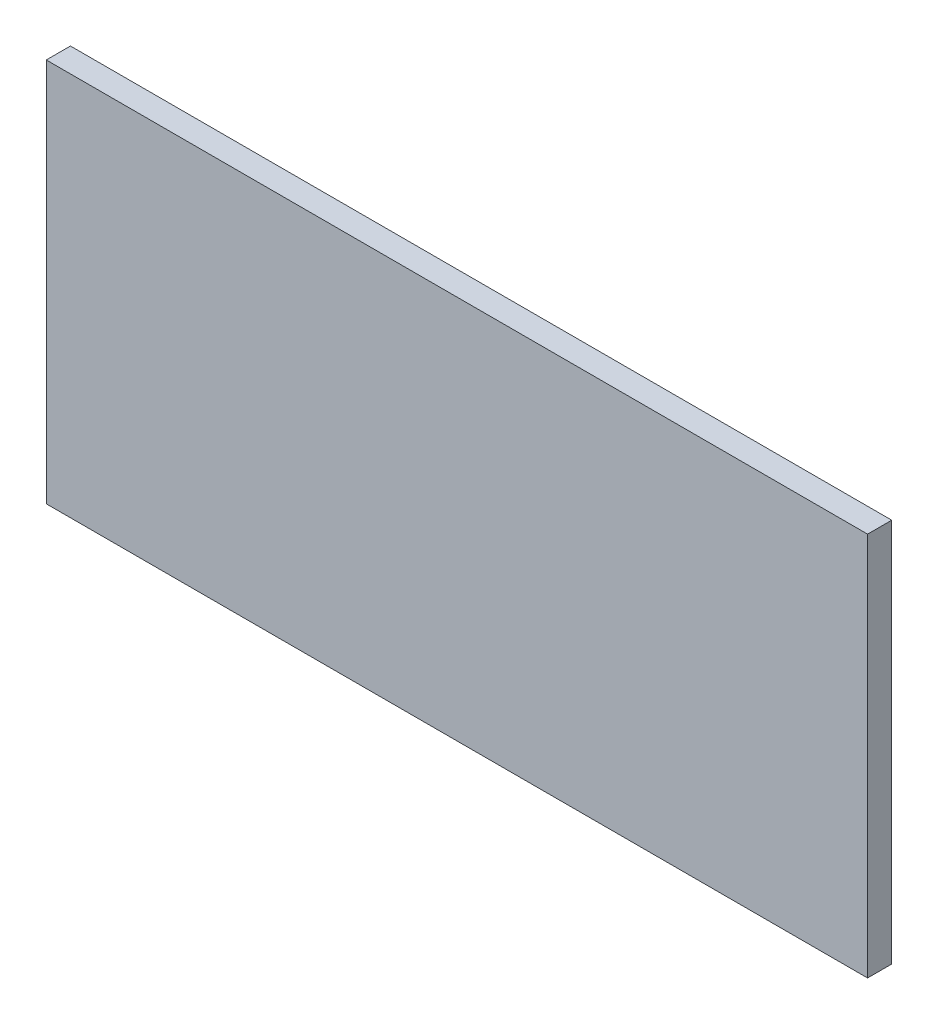
ISO-10303-21;
HEADER;
FILE_DESCRIPTION(('STEP AP214'),'2;1');
FILE_NAME('part.step','',(''),(''),'','','');
FILE_SCHEMA(('AUTOMOTIVE_DESIGN { 1 0 10303 214 1 1 1 1 }'));
ENDSEC;
DATA;
#1=APPLICATION_CONTEXT('core data for automotive mechanical design processes');
#2=APPLICATION_PROTOCOL_DEFINITION('international standard','automotive_design',2000,#1);
#3=PRODUCT_CONTEXT('',#1,'mechanical');
#4=PRODUCT('Part','Part','',(#3));
#5=PRODUCT_RELATED_PRODUCT_CATEGORY('part','',(#4));
#6=PRODUCT_DEFINITION_FORMATION('','',#4);
#7=PRODUCT_DEFINITION_CONTEXT('part definition',#1,'design');
#8=PRODUCT_DEFINITION('design','',#6,#7);
#9=PRODUCT_DEFINITION_SHAPE('','',#8);
#10=(LENGTH_UNIT() NAMED_UNIT(*) SI_UNIT(.MILLI.,.METRE.));
#11=(NAMED_UNIT(*) PLANE_ANGLE_UNIT() SI_UNIT($,.RADIAN.));
#12=(NAMED_UNIT(*) SI_UNIT($,.STERADIAN.) SOLID_ANGLE_UNIT());
#13=UNCERTAINTY_MEASURE_WITH_UNIT(LENGTH_MEASURE(1.E-05),#10,'distance_accuracy_value','');
#14=(GEOMETRIC_REPRESENTATION_CONTEXT(3) GLOBAL_UNCERTAINTY_ASSIGNED_CONTEXT((#13)) GLOBAL_UNIT_ASSIGNED_CONTEXT((#10,
#11,#12)) REPRESENTATION_CONTEXT('',''));
#15=CARTESIAN_POINT('',(0.,0.,0.));
#16=DIRECTION('',(0.,0.,1.));
#17=DIRECTION('',(1.,0.,0.));
#18=AXIS2_PLACEMENT_3D('',#15,#16,#17);
#19=CARTESIAN_POINT('',(104.774999999999,-1.19348975147204E-12,3.175));
#20=DIRECTION('',(-1.,0.,0.));
#21=DIRECTION('',(0.,0.,1.));
#22=AXIS2_PLACEMENT_3D('',#19,#20,#21);
#23=PLANE('',#22);
#24=DIRECTION('',(0.,1.,0.));
#25=VECTOR('',#24,1.);
#26=CARTESIAN_POINT('',(104.774999999999,-1.19348975147204E-12,0.));
#27=LINE('',#26,#25);
#28=CARTESIAN_POINT('',(104.774999999999,-50.5250000000025,0.));
#29=VERTEX_POINT('',#28);
#30=CARTESIAN_POINT('',(104.774999999999,-1.19348975147204E-12,0.));
#31=VERTEX_POINT('',#30);
#32=EDGE_CURVE('E97',#29,#31,#27,.T.);
#33=ORIENTED_EDGE('',*,*,#32,.T.);
#34=DIRECTION('',(0.,0.,-1.));
#35=VECTOR('',#34,1.);
#36=CARTESIAN_POINT('',(104.774999999999,-1.19348975147204E-12,3.175));
#37=LINE('',#36,#35);
#38=CARTESIAN_POINT('',(104.774999999999,-1.19348975147204E-12,3.175));
#39=VERTEX_POINT('',#38);
#40=EDGE_CURVE('E11',#39,#31,#37,.T.);
#41=ORIENTED_EDGE('',*,*,#40,.F.);
#42=DIRECTION('',(0.,1.,0.));
#43=VECTOR('',#42,1.);
#44=CARTESIAN_POINT('',(104.774999999999,-1.19348975147204E-12,3.175));
#45=LINE('',#44,#43);
#46=CARTESIAN_POINT('',(104.774999999999,-50.5250000000025,3.175));
#47=VERTEX_POINT('',#46);
#48=EDGE_CURVE('E85',#47,#39,#45,.T.);
#49=ORIENTED_EDGE('',*,*,#48,.F.);
#50=DIRECTION('',(0.,0.,-1.));
#51=VECTOR('',#50,1.);
#52=CARTESIAN_POINT('',(104.774999999999,-50.5250000000025,3.175));
#53=LINE('',#52,#51);
#54=EDGE_CURVE('E93',#47,#29,#53,.T.);
#55=ORIENTED_EDGE('',*,*,#54,.T.);
#56=EDGE_LOOP('',(#33,#41,#49,#55));
#57=FACE_BOUND('',#56,.T.);
#58=ADVANCED_FACE('F34',(#57),#23,.F.);
#59=CARTESIAN_POINT('',(104.774999999999,-1.19348975147204E-12,3.175));
#60=DIRECTION('',(0.,-1.,0.));
#61=DIRECTION('',(0.,0.,-1.));
#62=AXIS2_PLACEMENT_3D('',#59,#60,#61);
#63=PLANE('',#62);
#64=DIRECTION('',(-1.,0.,0.));
#65=VECTOR('',#64,1.);
#66=CARTESIAN_POINT('',(104.774999999999,-1.19348975147204E-12,0.));
#67=LINE('',#66,#65);
#68=CARTESIAN_POINT('',(-3.17500000000105,-1.19348975147204E-12,0.));
#69=VERTEX_POINT('',#68);
#70=EDGE_CURVE('E89',#31,#69,#67,.T.);
#71=ORIENTED_EDGE('',*,*,#70,.T.);
#72=DIRECTION('',(0.,0.,-1.));
#73=VECTOR('',#72,1.);
#74=CARTESIAN_POINT('',(-3.17500000000105,-1.19348975147204E-12,3.175));
#75=LINE('',#74,#73);
#76=CARTESIAN_POINT('',(-3.17500000000105,-1.19348975147204E-12,3.175));
#77=VERTEX_POINT('',#76);
#78=EDGE_CURVE('E42',#77,#69,#75,.T.);
#79=ORIENTED_EDGE('',*,*,#78,.F.);
#80=DIRECTION('',(-1.,0.,0.));
#81=VECTOR('',#80,1.);
#82=CARTESIAN_POINT('',(104.774999999999,-1.19348975147204E-12,3.175));
#83=LINE('',#82,#81);
#84=EDGE_CURVE('E80',#39,#77,#83,.T.);
#85=ORIENTED_EDGE('',*,*,#84,.F.);
#86=ORIENTED_EDGE('',*,*,#40,.T.);
#87=EDGE_LOOP('',(#71,#79,#85,#86));
#88=FACE_BOUND('',#87,.T.);
#89=ADVANCED_FACE('F88',(#88),#63,.F.);
#90=CARTESIAN_POINT('',(-3.17500000000105,-1.19348975147204E-12,3.175));
#91=DIRECTION('',(1.,0.,0.));
#92=DIRECTION('',(0.,0.,-1.));
#93=AXIS2_PLACEMENT_3D('',#90,#91,#92);
#94=PLANE('',#93);
#95=DIRECTION('',(0.,-1.,0.));
#96=VECTOR('',#95,1.);
#97=CARTESIAN_POINT('',(-3.17500000000105,-1.19348975147204E-12,0.));
#98=LINE('',#97,#96);
#99=CARTESIAN_POINT('',(-3.17500000000105,-50.5250000000025,0.));
#100=VERTEX_POINT('',#99);
#101=EDGE_CURVE('E67',#69,#100,#98,.T.);
#102=ORIENTED_EDGE('',*,*,#101,.T.);
#103=DIRECTION('',(0.,0.,-1.));
#104=VECTOR('',#103,1.);
#105=CARTESIAN_POINT('',(-3.17500000000105,-50.5250000000025,3.175));
#106=LINE('',#105,#104);
#107=CARTESIAN_POINT('',(-3.17500000000105,-50.5250000000025,3.175));
#108=VERTEX_POINT('',#107);
#109=EDGE_CURVE('E90',#108,#100,#106,.T.);
#110=ORIENTED_EDGE('',*,*,#109,.F.);
#111=DIRECTION('',(0.,-1.,0.));
#112=VECTOR('',#111,1.);
#113=CARTESIAN_POINT('',(-3.17500000000105,-1.19348975147204E-12,3.175));
#114=LINE('',#113,#112);
#115=EDGE_CURVE('E83',#77,#108,#114,.T.);
#116=ORIENTED_EDGE('',*,*,#115,.F.);
#117=ORIENTED_EDGE('',*,*,#78,.T.);
#118=EDGE_LOOP('',(#102,#110,#116,#117));
#119=FACE_BOUND('',#118,.T.);
#120=ADVANCED_FACE('F91',(#119),#94,.F.);
#121=CARTESIAN_POINT('',(104.774999999999,-50.5250000000025,3.175));
#122=DIRECTION('',(0.,1.,0.));
#123=DIRECTION('',(0.,0.,1.));
#124=AXIS2_PLACEMENT_3D('',#121,#122,#123);
#125=PLANE('',#124);
#126=DIRECTION('',(1.,0.,0.));
#127=VECTOR('',#126,1.);
#128=CARTESIAN_POINT('',(104.774999999999,-50.5250000000025,0.));
#129=LINE('',#128,#127);
#130=EDGE_CURVE('E73',#100,#29,#129,.T.);
#131=ORIENTED_EDGE('',*,*,#130,.T.);
#132=ORIENTED_EDGE('',*,*,#54,.F.);
#133=DIRECTION('',(1.,0.,0.));
#134=VECTOR('',#133,1.);
#135=CARTESIAN_POINT('',(104.774999999999,-50.5250000000025,3.175));
#136=LINE('',#135,#134);
#137=EDGE_CURVE('E50',#108,#47,#136,.T.);
#138=ORIENTED_EDGE('',*,*,#137,.F.);
#139=ORIENTED_EDGE('',*,*,#109,.T.);
#140=EDGE_LOOP('',(#131,#132,#138,#139));
#141=FACE_BOUND('',#140,.T.);
#142=ADVANCED_FACE('F104',(#141),#125,.F.);
#143=CARTESIAN_POINT('',(0.,0.,3.175));
#144=DIRECTION('',(0.,0.,-1.));
#145=DIRECTION('',(-1.,0.,0.));
#146=AXIS2_PLACEMENT_3D('',#143,#144,#145);
#147=PLANE('',#146);
#148=ORIENTED_EDGE('',*,*,#48,.T.);
#149=ORIENTED_EDGE('',*,*,#84,.T.);
#150=ORIENTED_EDGE('',*,*,#115,.T.);
#151=ORIENTED_EDGE('',*,*,#137,.T.);
#152=EDGE_LOOP('',(#148,#149,#150,#151));
#153=FACE_BOUND('',#152,.T.);
#154=ADVANCED_FACE('F81',(#153),#147,.F.);
#155=CARTESIAN_POINT('',(0.,0.,0.));
#156=DIRECTION('',(0.,0.,-1.));
#157=DIRECTION('',(-1.,0.,0.));
#158=AXIS2_PLACEMENT_3D('',#155,#156,#157);
#159=PLANE('',#158);
#160=ORIENTED_EDGE('',*,*,#32,.F.);
#161=ORIENTED_EDGE('',*,*,#130,.F.);
#162=ORIENTED_EDGE('',*,*,#101,.F.);
#163=ORIENTED_EDGE('',*,*,#70,.F.);
#164=EDGE_LOOP('',(#160,#161,#162,#163));
#165=FACE_BOUND('',#164,.T.);
#166=ADVANCED_FACE('F107',(#165),#159,.T.);
#167=CLOSED_SHELL('',(#58,#89,#120,#142,#154,#166));
#168=MANIFOLD_SOLID_BREP('B2',#167);
#169=ADVANCED_BREP_SHAPE_REPRESENTATION('',(#18,#168),#14);
#170=SHAPE_DEFINITION_REPRESENTATION(#9,#169);
ENDSEC;
END-ISO-10303-21;
